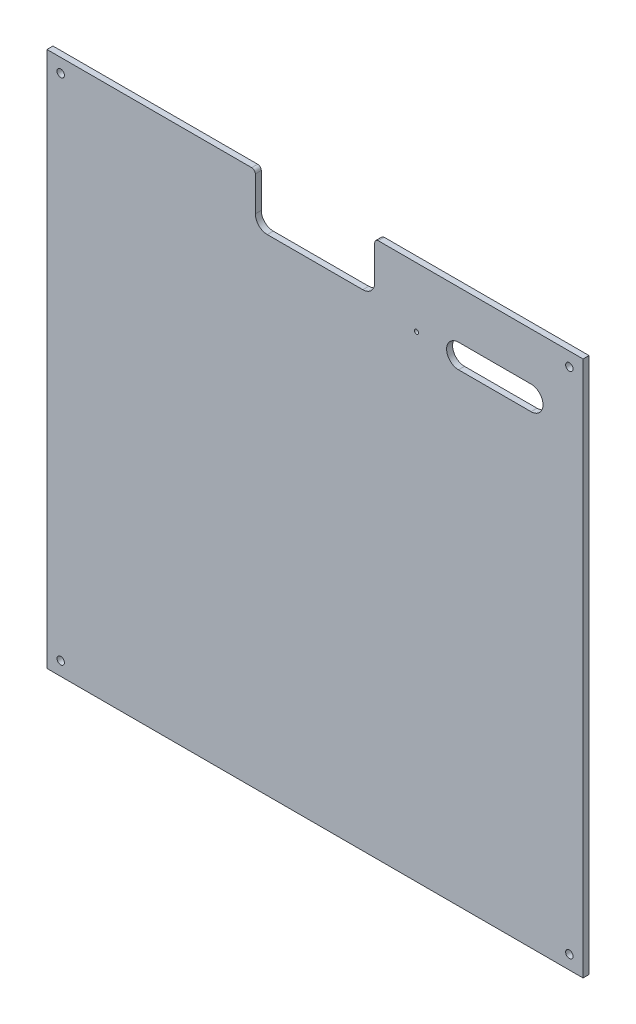
ISO-10303-21;
HEADER;
FILE_DESCRIPTION(('STEP AP214'),'2;1');
FILE_NAME('part.step','',(''),(''),'','','');
FILE_SCHEMA(('AUTOMOTIVE_DESIGN { 1 0 10303 214 1 1 1 1 }'));
ENDSEC;
DATA;
#1=APPLICATION_CONTEXT('core data for automotive mechanical design processes');
#2=APPLICATION_PROTOCOL_DEFINITION('international standard','automotive_design',2000,#1);
#3=PRODUCT_CONTEXT('',#1,'mechanical');
#4=PRODUCT('Part','Part','',(#3));
#5=PRODUCT_RELATED_PRODUCT_CATEGORY('part','',(#4));
#6=PRODUCT_DEFINITION_FORMATION('','',#4);
#7=PRODUCT_DEFINITION_CONTEXT('part definition',#1,'design');
#8=PRODUCT_DEFINITION('design','',#6,#7);
#9=PRODUCT_DEFINITION_SHAPE('','',#8);
#10=(LENGTH_UNIT() NAMED_UNIT(*) SI_UNIT(.MILLI.,.METRE.));
#11=(NAMED_UNIT(*) PLANE_ANGLE_UNIT() SI_UNIT($,.RADIAN.));
#12=(NAMED_UNIT(*) SI_UNIT($,.STERADIAN.) SOLID_ANGLE_UNIT());
#13=UNCERTAINTY_MEASURE_WITH_UNIT(LENGTH_MEASURE(1.E-05),#10,'distance_accuracy_value','');
#14=(GEOMETRIC_REPRESENTATION_CONTEXT(3) GLOBAL_UNCERTAINTY_ASSIGNED_CONTEXT((#13)) GLOBAL_UNIT_ASSIGNED_CONTEXT((#10,
#11,#12)) REPRESENTATION_CONTEXT('',''));
#15=CARTESIAN_POINT('',(0.,0.,0.));
#16=DIRECTION('',(0.,0.,1.));
#17=DIRECTION('',(1.,0.,0.));
#18=AXIS2_PLACEMENT_3D('',#15,#16,#17);
#19=CARTESIAN_POINT('',(171.5,446.,5.));
#20=DIRECTION('',(0.,0.,1.));
#21=DIRECTION('',(1.,0.,0.));
#22=AXIS2_PLACEMENT_3D('',#19,#20,#21);
#23=PLANE('',#22);
#24=DIRECTION('',(1.,0.,0.));
#25=VECTOR('',#24,1.);
#26=CARTESIAN_POINT('',(344.715899344631,389.,5.));
#27=LINE('',#26,#25);
#28=CARTESIAN_POINT('',(344.715899344631,389.,5.));
#29=VERTEX_POINT('',#28);
#30=CARTESIAN_POINT('',(405.440355678252,389.,5.));
#31=VERTEX_POINT('',#30);
#32=EDGE_CURVE('E164',#29,#31,#27,.T.);
#33=ORIENTED_EDGE('',*,*,#32,.F.);
#34=CARTESIAN_POINT('',(344.715899344631,399.,5.));
#35=DIRECTION('',(0.,0.,1.));
#36=DIRECTION('',(1.,0.,0.));
#37=AXIS2_PLACEMENT_3D('',#34,#35,#36);
#38=CIRCLE('',#37,10.);
#39=CARTESIAN_POINT('',(344.715899344631,409.,5.));
#40=VERTEX_POINT('',#39);
#41=EDGE_CURVE('E155',#40,#29,#38,.T.);
#42=ORIENTED_EDGE('',*,*,#41,.F.);
#43=DIRECTION('',(-1.,0.,0.));
#44=VECTOR('',#43,1.);
#45=CARTESIAN_POINT('',(344.715899344631,409.,5.));
#46=LINE('',#45,#44);
#47=CARTESIAN_POINT('',(405.440355678252,409.,5.));
#48=VERTEX_POINT('',#47);
#49=EDGE_CURVE('E181',#48,#40,#46,.T.);
#50=ORIENTED_EDGE('',*,*,#49,.F.);
#51=CARTESIAN_POINT('',(405.440355678252,399.,5.));
#52=DIRECTION('',(0.,0.,1.));
#53=DIRECTION('',(1.,0.,0.));
#54=AXIS2_PLACEMENT_3D('',#51,#52,#53);
#55=CIRCLE('',#54,10.);
#56=EDGE_CURVE('E177',#31,#48,#55,.T.);
#57=ORIENTED_EDGE('',*,*,#56,.F.);
#58=EDGE_LOOP('',(#33,#42,#50,#57));
#59=FACE_BOUND('',#58,.T.);
#60=CARTESIAN_POINT('',(11.5,437.5,5.));
#61=DIRECTION('',(0.,0.,1.));
#62=DIRECTION('',(-1.,0.,0.));
#63=AXIS2_PLACEMENT_3D('',#60,#61,#62);
#64=CIRCLE('',#63,3.1);
#65=CARTESIAN_POINT('',(8.4,437.5,5.));
#66=VERTEX_POINT('',#65);
#67=EDGE_CURVE('E277',#66,#66,#64,.T.);
#68=ORIENTED_EDGE('',*,*,#67,.F.);
#69=EDGE_LOOP('',(#68));
#70=FACE_BOUND('',#69,.T.);
#71=CARTESIAN_POINT('',(437.5,11.5,5.));
#72=DIRECTION('',(0.,0.,1.));
#73=DIRECTION('',(-1.,0.,0.));
#74=AXIS2_PLACEMENT_3D('',#71,#72,#73);
#75=CIRCLE('',#74,3.09999999999999);
#76=CARTESIAN_POINT('',(434.4,11.5,5.));
#77=VERTEX_POINT('',#76);
#78=EDGE_CURVE('E467',#77,#77,#75,.T.);
#79=ORIENTED_EDGE('',*,*,#78,.F.);
#80=EDGE_LOOP('',(#79));
#81=FACE_BOUND('',#80,.T.);
#82=DIRECTION('',(1.,0.,0.));
#83=VECTOR('',#82,1.);
#84=CARTESIAN_POINT('',(449.,0.,5.));
#85=LINE('',#84,#83);
#86=CARTESIAN_POINT('',(0.,0.,5.));
#87=VERTEX_POINT('',#86);
#88=CARTESIAN_POINT('',(449.,0.,5.));
#89=VERTEX_POINT('',#88);
#90=EDGE_CURVE('E425',#87,#89,#85,.T.);
#91=ORIENTED_EDGE('',*,*,#90,.T.);
#92=DIRECTION('',(0.,1.,0.));
#93=VECTOR('',#92,1.);
#94=CARTESIAN_POINT('',(449.,449.,5.));
#95=LINE('',#94,#93);
#96=CARTESIAN_POINT('',(449.,449.,5.));
#97=VERTEX_POINT('',#96);
#98=EDGE_CURVE('E458',#89,#97,#95,.T.);
#99=ORIENTED_EDGE('',*,*,#98,.T.);
#100=DIRECTION('',(-1.,0.,0.));
#101=VECTOR('',#100,1.);
#102=CARTESIAN_POINT('',(277.5,449.,5.));
#103=LINE('',#102,#101);
#104=CARTESIAN_POINT('',(277.5,449.,5.));
#105=VERTEX_POINT('',#104);
#106=EDGE_CURVE('E400',#97,#105,#103,.T.);
#107=ORIENTED_EDGE('',*,*,#106,.T.);
#108=CARTESIAN_POINT('',(277.5,446.,5.));
#109=DIRECTION('',(0.,0.,1.));
#110=DIRECTION('',(1.,0.,0.));
#111=AXIS2_PLACEMENT_3D('',#108,#109,#110);
#112=CIRCLE('',#111,3.);
#113=CARTESIAN_POINT('',(274.5,446.,5.));
#114=VERTEX_POINT('',#113);
#115=EDGE_CURVE('E212',#105,#114,#112,.T.);
#116=ORIENTED_EDGE('',*,*,#115,.T.);
#117=DIRECTION('',(0.,-1.,0.));
#118=VECTOR('',#117,1.);
#119=CARTESIAN_POINT('',(274.5,417.,5.));
#120=LINE('',#119,#118);
#121=CARTESIAN_POINT('',(274.5,417.,5.));
#122=VERTEX_POINT('',#121);
#123=EDGE_CURVE('E207',#114,#122,#120,.T.);
#124=ORIENTED_EDGE('',*,*,#123,.T.);
#125=CARTESIAN_POINT('',(264.5,417.,5.));
#126=DIRECTION('',(0.,0.,-1.));
#127=DIRECTION('',(-1.,0.,0.));
#128=AXIS2_PLACEMENT_3D('',#125,#126,#127);
#129=CIRCLE('',#128,10.);
#130=CARTESIAN_POINT('',(264.5,407.,5.));
#131=VERTEX_POINT('',#130);
#132=EDGE_CURVE('E211',#122,#131,#129,.T.);
#133=ORIENTED_EDGE('',*,*,#132,.T.);
#134=DIRECTION('',(-1.,0.,0.));
#135=VECTOR('',#134,1.);
#136=CARTESIAN_POINT('',(184.5,407.,5.));
#137=LINE('',#136,#135);
#138=CARTESIAN_POINT('',(184.5,407.,5.));
#139=VERTEX_POINT('',#138);
#140=EDGE_CURVE('E228',#131,#139,#137,.T.);
#141=ORIENTED_EDGE('',*,*,#140,.T.);
#142=CARTESIAN_POINT('',(184.5,417.,5.));
#143=DIRECTION('',(0.,0.,-1.));
#144=DIRECTION('',(1.,0.,0.));
#145=AXIS2_PLACEMENT_3D('',#142,#143,#144);
#146=CIRCLE('',#145,10.);
#147=CARTESIAN_POINT('',(174.5,417.,5.));
#148=VERTEX_POINT('',#147);
#149=EDGE_CURVE('E231',#139,#148,#146,.T.);
#150=ORIENTED_EDGE('',*,*,#149,.T.);
#151=DIRECTION('',(0.,1.,0.));
#152=VECTOR('',#151,1.);
#153=CARTESIAN_POINT('',(174.5,446.,5.));
#154=LINE('',#153,#152);
#155=CARTESIAN_POINT('',(174.5,446.,5.));
#156=VERTEX_POINT('',#155);
#157=EDGE_CURVE('E244',#148,#156,#154,.T.);
#158=ORIENTED_EDGE('',*,*,#157,.T.);
#159=CARTESIAN_POINT('',(171.5,446.,5.));
#160=DIRECTION('',(0.,0.,1.));
#161=DIRECTION('',(1.,0.,0.));
#162=AXIS2_PLACEMENT_3D('',#159,#160,#161);
#163=CIRCLE('',#162,2.99999999999998);
#164=CARTESIAN_POINT('',(171.5,449.,5.));
#165=VERTEX_POINT('',#164);
#166=EDGE_CURVE('E248',#156,#165,#163,.T.);
#167=ORIENTED_EDGE('',*,*,#166,.T.);
#168=DIRECTION('',(-1.,0.,0.));
#169=VECTOR('',#168,1.);
#170=CARTESIAN_POINT('',(0.,449.,5.));
#171=LINE('',#170,#169);
#172=CARTESIAN_POINT('',(0.,449.,5.));
#173=VERTEX_POINT('',#172);
#174=EDGE_CURVE('E654',#165,#173,#171,.T.);
#175=ORIENTED_EDGE('',*,*,#174,.T.);
#176=DIRECTION('',(0.,-1.,0.));
#177=VECTOR('',#176,1.);
#178=CARTESIAN_POINT('',(0.,0.,5.));
#179=LINE('',#178,#177);
#180=EDGE_CURVE('E430',#173,#87,#179,.T.);
#181=ORIENTED_EDGE('',*,*,#180,.T.);
#182=EDGE_LOOP('',(#91,#99,#107,#116,#124,#133,#141,#150,#158,#167,#175,#181));
#183=FACE_BOUND('',#182,.T.);
#184=CARTESIAN_POINT('',(11.5,11.5,5.));
#185=DIRECTION('',(0.,0.,1.));
#186=DIRECTION('',(1.,0.,0.));
#187=AXIS2_PLACEMENT_3D('',#184,#185,#186);
#188=CIRCLE('',#187,3.1);
#189=CARTESIAN_POINT('',(14.6,11.5,5.));
#190=VERTEX_POINT('',#189);
#191=EDGE_CURVE('E466',#190,#190,#188,.T.);
#192=ORIENTED_EDGE('',*,*,#191,.F.);
#193=EDGE_LOOP('',(#192));
#194=FACE_BOUND('',#193,.T.);
#195=CARTESIAN_POINT('',(437.5,437.5,5.));
#196=DIRECTION('',(0.,0.,1.));
#197=DIRECTION('',(1.,0.,0.));
#198=AXIS2_PLACEMENT_3D('',#195,#196,#197);
#199=CIRCLE('',#198,3.09999999999999);
#200=CARTESIAN_POINT('',(440.6,437.5,5.));
#201=VERTEX_POINT('',#200);
#202=EDGE_CURVE('E259',#201,#201,#199,.T.);
#203=ORIENTED_EDGE('',*,*,#202,.F.);
#204=EDGE_LOOP('',(#203));
#205=FACE_BOUND('',#204,.T.);
#206=CARTESIAN_POINT('',(309.5,399.,5.));
#207=DIRECTION('',(0.,0.,1.));
#208=DIRECTION('',(1.,0.,0.));
#209=AXIS2_PLACEMENT_3D('',#206,#207,#208);
#210=CIRCLE('',#209,1.74999999999998);
#211=CARTESIAN_POINT('',(311.25,399.,5.));
#212=VERTEX_POINT('',#211);
#213=EDGE_CURVE('E289',#212,#212,#210,.T.);
#214=ORIENTED_EDGE('',*,*,#213,.F.);
#215=EDGE_LOOP('',(#214));
#216=FACE_BOUND('',#215,.T.);
#217=ADVANCED_FACE('F41',(#59,#70,#81,#183,#194,#205,#216),#23,.T.);
#218=CARTESIAN_POINT('',(171.5,446.,0.));
#219=DIRECTION('',(0.,0.,1.));
#220=DIRECTION('',(1.,0.,0.));
#221=AXIS2_PLACEMENT_3D('',#218,#219,#220);
#222=PLANE('',#221);
#223=CARTESIAN_POINT('',(11.5,437.5,0.));
#224=DIRECTION('',(0.,0.,1.));
#225=DIRECTION('',(-1.,0.,0.));
#226=AXIS2_PLACEMENT_3D('',#223,#224,#225);
#227=CIRCLE('',#226,3.1);
#228=CARTESIAN_POINT('',(8.4,437.5,0.));
#229=VERTEX_POINT('',#228);
#230=EDGE_CURVE('E172',#229,#229,#227,.T.);
#231=ORIENTED_EDGE('',*,*,#230,.T.);
#232=EDGE_LOOP('',(#231));
#233=FACE_BOUND('',#232,.T.);
#234=CARTESIAN_POINT('',(437.5,437.5,0.));
#235=DIRECTION('',(0.,0.,1.));
#236=DIRECTION('',(1.,0.,0.));
#237=AXIS2_PLACEMENT_3D('',#234,#235,#236);
#238=CIRCLE('',#237,3.09999999999999);
#239=CARTESIAN_POINT('',(440.6,437.5,0.));
#240=VERTEX_POINT('',#239);
#241=EDGE_CURVE('E266',#240,#240,#238,.T.);
#242=ORIENTED_EDGE('',*,*,#241,.T.);
#243=EDGE_LOOP('',(#242));
#244=FACE_BOUND('',#243,.T.);
#245=CARTESIAN_POINT('',(437.5,11.5,0.));
#246=DIRECTION('',(0.,0.,1.));
#247=DIRECTION('',(-1.,0.,0.));
#248=AXIS2_PLACEMENT_3D('',#245,#246,#247);
#249=CIRCLE('',#248,3.09999999999999);
#250=CARTESIAN_POINT('',(434.4,11.5,0.));
#251=VERTEX_POINT('',#250);
#252=EDGE_CURVE('E265',#251,#251,#249,.T.);
#253=ORIENTED_EDGE('',*,*,#252,.T.);
#254=EDGE_LOOP('',(#253));
#255=FACE_BOUND('',#254,.T.);
#256=CARTESIAN_POINT('',(11.5,11.5,0.));
#257=DIRECTION('',(0.,0.,1.));
#258=DIRECTION('',(1.,0.,0.));
#259=AXIS2_PLACEMENT_3D('',#256,#257,#258);
#260=CIRCLE('',#259,3.1);
#261=CARTESIAN_POINT('',(14.6,11.5,0.));
#262=VERTEX_POINT('',#261);
#263=EDGE_CURVE('E463',#262,#262,#260,.T.);
#264=ORIENTED_EDGE('',*,*,#263,.T.);
#265=EDGE_LOOP('',(#264));
#266=FACE_BOUND('',#265,.T.);
#267=DIRECTION('',(1.,0.,0.));
#268=VECTOR('',#267,1.);
#269=CARTESIAN_POINT('',(449.,0.,0.));
#270=LINE('',#269,#268);
#271=CARTESIAN_POINT('',(0.,0.,0.));
#272=VERTEX_POINT('',#271);
#273=CARTESIAN_POINT('',(449.,0.,0.));
#274=VERTEX_POINT('',#273);
#275=EDGE_CURVE('E396',#272,#274,#270,.T.);
#276=ORIENTED_EDGE('',*,*,#275,.F.);
#277=DIRECTION('',(0.,-1.,0.));
#278=VECTOR('',#277,1.);
#279=CARTESIAN_POINT('',(0.,0.,0.));
#280=LINE('',#279,#278);
#281=CARTESIAN_POINT('',(0.,449.,0.));
#282=VERTEX_POINT('',#281);
#283=EDGE_CURVE('E423',#282,#272,#280,.T.);
#284=ORIENTED_EDGE('',*,*,#283,.F.);
#285=DIRECTION('',(-1.,0.,0.));
#286=VECTOR('',#285,1.);
#287=CARTESIAN_POINT('',(0.,449.,0.));
#288=LINE('',#287,#286);
#289=CARTESIAN_POINT('',(171.5,449.,0.));
#290=VERTEX_POINT('',#289);
#291=EDGE_CURVE('E421',#290,#282,#288,.T.);
#292=ORIENTED_EDGE('',*,*,#291,.F.);
#293=CARTESIAN_POINT('',(171.5,446.,0.));
#294=DIRECTION('',(0.,0.,1.));
#295=DIRECTION('',(1.,0.,0.));
#296=AXIS2_PLACEMENT_3D('',#293,#294,#295);
#297=CIRCLE('',#296,2.99999999999998);
#298=CARTESIAN_POINT('',(174.5,446.,0.));
#299=VERTEX_POINT('',#298);
#300=EDGE_CURVE('E419',#299,#290,#297,.T.);
#301=ORIENTED_EDGE('',*,*,#300,.F.);
#302=DIRECTION('',(0.,1.,0.));
#303=VECTOR('',#302,1.);
#304=CARTESIAN_POINT('',(174.5,446.,0.));
#305=LINE('',#304,#303);
#306=CARTESIAN_POINT('',(174.5,417.,0.));
#307=VERTEX_POINT('',#306);
#308=EDGE_CURVE('E417',#307,#299,#305,.T.);
#309=ORIENTED_EDGE('',*,*,#308,.F.);
#310=CARTESIAN_POINT('',(184.5,417.,0.));
#311=DIRECTION('',(0.,0.,-1.));
#312=DIRECTION('',(1.,0.,0.));
#313=AXIS2_PLACEMENT_3D('',#310,#311,#312);
#314=CIRCLE('',#313,10.);
#315=CARTESIAN_POINT('',(184.5,407.,0.));
#316=VERTEX_POINT('',#315);
#317=EDGE_CURVE('E415',#316,#307,#314,.T.);
#318=ORIENTED_EDGE('',*,*,#317,.F.);
#319=DIRECTION('',(-1.,0.,0.));
#320=VECTOR('',#319,1.);
#321=CARTESIAN_POINT('',(184.5,407.,0.));
#322=LINE('',#321,#320);
#323=CARTESIAN_POINT('',(264.5,407.,0.));
#324=VERTEX_POINT('',#323);
#325=EDGE_CURVE('E413',#324,#316,#322,.T.);
#326=ORIENTED_EDGE('',*,*,#325,.F.);
#327=CARTESIAN_POINT('',(264.5,417.,0.));
#328=DIRECTION('',(0.,0.,-1.));
#329=DIRECTION('',(-1.,0.,0.));
#330=AXIS2_PLACEMENT_3D('',#327,#328,#329);
#331=CIRCLE('',#330,10.);
#332=CARTESIAN_POINT('',(274.5,417.,0.));
#333=VERTEX_POINT('',#332);
#334=EDGE_CURVE('E411',#333,#324,#331,.T.);
#335=ORIENTED_EDGE('',*,*,#334,.F.);
#336=DIRECTION('',(0.,-1.,0.));
#337=VECTOR('',#336,1.);
#338=CARTESIAN_POINT('',(274.5,417.,0.));
#339=LINE('',#338,#337);
#340=CARTESIAN_POINT('',(274.5,446.,0.));
#341=VERTEX_POINT('',#340);
#342=EDGE_CURVE('E406',#341,#333,#339,.T.);
#343=ORIENTED_EDGE('',*,*,#342,.F.);
#344=CARTESIAN_POINT('',(277.5,446.,0.));
#345=DIRECTION('',(0.,0.,1.));
#346=DIRECTION('',(1.,0.,0.));
#347=AXIS2_PLACEMENT_3D('',#344,#345,#346);
#348=CIRCLE('',#347,3.);
#349=CARTESIAN_POINT('',(277.5,449.,0.));
#350=VERTEX_POINT('',#349);
#351=EDGE_CURVE('E404',#350,#341,#348,.T.);
#352=ORIENTED_EDGE('',*,*,#351,.F.);
#353=DIRECTION('',(-1.,0.,0.));
#354=VECTOR('',#353,1.);
#355=CARTESIAN_POINT('',(277.5,449.,0.));
#356=LINE('',#355,#354);
#357=CARTESIAN_POINT('',(449.,449.,0.));
#358=VERTEX_POINT('',#357);
#359=EDGE_CURVE('E395',#358,#350,#356,.T.);
#360=ORIENTED_EDGE('',*,*,#359,.F.);
#361=DIRECTION('',(0.,1.,0.));
#362=VECTOR('',#361,1.);
#363=CARTESIAN_POINT('',(449.,449.,0.));
#364=LINE('',#363,#362);
#365=EDGE_CURVE('E387',#274,#358,#364,.T.);
#366=ORIENTED_EDGE('',*,*,#365,.F.);
#367=EDGE_LOOP('',(#276,#284,#292,#301,#309,#318,#326,#335,#343,#352,#360,#366));
#368=FACE_BOUND('',#367,.T.);
#369=CARTESIAN_POINT('',(344.715899344631,399.,0.));
#370=DIRECTION('',(0.,0.,1.));
#371=DIRECTION('',(1.,0.,0.));
#372=AXIS2_PLACEMENT_3D('',#369,#370,#371);
#373=CIRCLE('',#372,10.);
#374=CARTESIAN_POINT('',(344.715899344631,409.,0.));
#375=VERTEX_POINT('',#374);
#376=CARTESIAN_POINT('',(344.715899344631,389.,0.));
#377=VERTEX_POINT('',#376);
#378=EDGE_CURVE('E64',#375,#377,#373,.T.);
#379=ORIENTED_EDGE('',*,*,#378,.T.);
#380=DIRECTION('',(1.,0.,0.));
#381=VECTOR('',#380,1.);
#382=CARTESIAN_POINT('',(344.715899344631,389.,0.));
#383=LINE('',#382,#381);
#384=CARTESIAN_POINT('',(405.440355678252,389.,0.));
#385=VERTEX_POINT('',#384);
#386=EDGE_CURVE('E171',#377,#385,#383,.T.);
#387=ORIENTED_EDGE('',*,*,#386,.T.);
#388=CARTESIAN_POINT('',(405.440355678252,399.,0.));
#389=DIRECTION('',(0.,0.,1.));
#390=DIRECTION('',(1.,0.,0.));
#391=AXIS2_PLACEMENT_3D('',#388,#389,#390);
#392=CIRCLE('',#391,10.);
#393=CARTESIAN_POINT('',(405.440355678252,409.,0.));
#394=VERTEX_POINT('',#393);
#395=EDGE_CURVE('E306',#385,#394,#392,.T.);
#396=ORIENTED_EDGE('',*,*,#395,.T.);
#397=DIRECTION('',(-1.,0.,0.));
#398=VECTOR('',#397,1.);
#399=CARTESIAN_POINT('',(344.715899344631,409.,0.));
#400=LINE('',#399,#398);
#401=EDGE_CURVE('E165',#394,#375,#400,.T.);
#402=ORIENTED_EDGE('',*,*,#401,.T.);
#403=EDGE_LOOP('',(#379,#387,#396,#402));
#404=FACE_BOUND('',#403,.T.);
#405=CARTESIAN_POINT('',(309.5,399.,0.));
#406=DIRECTION('',(0.,0.,1.));
#407=DIRECTION('',(1.,0.,0.));
#408=AXIS2_PLACEMENT_3D('',#405,#406,#407);
#409=CIRCLE('',#408,1.74999999999998);
#410=CARTESIAN_POINT('',(311.25,399.,0.));
#411=VERTEX_POINT('',#410);
#412=EDGE_CURVE('E293',#411,#411,#409,.T.);
#413=ORIENTED_EDGE('',*,*,#412,.T.);
#414=EDGE_LOOP('',(#413));
#415=FACE_BOUND('',#414,.T.);
#416=ADVANCED_FACE('F316',(#233,#244,#255,#266,#368,#404,#415),#222,.F.);
#417=CARTESIAN_POINT('',(449.,0.,5.));
#418=DIRECTION('',(0.,1.,0.));
#419=DIRECTION('',(0.,0.,1.));
#420=AXIS2_PLACEMENT_3D('',#417,#418,#419);
#421=PLANE('',#420);
#422=ORIENTED_EDGE('',*,*,#275,.T.);
#423=DIRECTION('',(0.,0.,-1.));
#424=VECTOR('',#423,1.);
#425=CARTESIAN_POINT('',(449.,0.,5.));
#426=LINE('',#425,#424);
#427=EDGE_CURVE('E12',#89,#274,#426,.T.);
#428=ORIENTED_EDGE('',*,*,#427,.F.);
#429=ORIENTED_EDGE('',*,*,#90,.F.);
#430=DIRECTION('',(0.,0.,-1.));
#431=VECTOR('',#430,1.);
#432=CARTESIAN_POINT('',(0.,0.,5.));
#433=LINE('',#432,#431);
#434=EDGE_CURVE('E426',#87,#272,#433,.T.);
#435=ORIENTED_EDGE('',*,*,#434,.T.);
#436=EDGE_LOOP('',(#422,#428,#429,#435));
#437=FACE_BOUND('',#436,.T.);
#438=ADVANCED_FACE('F43',(#437),#421,.F.);
#439=CARTESIAN_POINT('',(449.,449.,5.));
#440=DIRECTION('',(-1.,0.,0.));
#441=DIRECTION('',(0.,-1.,0.));
#442=AXIS2_PLACEMENT_3D('',#439,#440,#441);
#443=PLANE('',#442);
#444=ORIENTED_EDGE('',*,*,#365,.T.);
#445=DIRECTION('',(0.,0.,-1.));
#446=VECTOR('',#445,1.);
#447=CARTESIAN_POINT('',(449.,449.,5.));
#448=LINE('',#447,#446);
#449=EDGE_CURVE('E49',#97,#358,#448,.T.);
#450=ORIENTED_EDGE('',*,*,#449,.F.);
#451=ORIENTED_EDGE('',*,*,#98,.F.);
#452=ORIENTED_EDGE('',*,*,#427,.T.);
#453=EDGE_LOOP('',(#444,#450,#451,#452));
#454=FACE_BOUND('',#453,.T.);
#455=ADVANCED_FACE('F378',(#454),#443,.F.);
#456=CARTESIAN_POINT('',(277.5,449.,5.));
#457=DIRECTION('',(0.,-1.,0.));
#458=DIRECTION('',(0.,0.,-1.));
#459=AXIS2_PLACEMENT_3D('',#456,#457,#458);
#460=PLANE('',#459);
#461=ORIENTED_EDGE('',*,*,#359,.T.);
#462=DIRECTION('',(0.,0.,-1.));
#463=VECTOR('',#462,1.);
#464=CARTESIAN_POINT('',(277.5,449.,5.));
#465=LINE('',#464,#463);
#466=EDGE_CURVE('E401',#105,#350,#465,.T.);
#467=ORIENTED_EDGE('',*,*,#466,.F.);
#468=ORIENTED_EDGE('',*,*,#106,.F.);
#469=ORIENTED_EDGE('',*,*,#449,.T.);
#470=EDGE_LOOP('',(#461,#467,#468,#469));
#471=FACE_BOUND('',#470,.T.);
#472=ADVANCED_FACE('F375',(#471),#460,.F.);
#473=CARTESIAN_POINT('',(277.5,446.,5.));
#474=DIRECTION('',(0.,0.,-1.));
#475=DIRECTION('',(-1.,0.,0.));
#476=AXIS2_PLACEMENT_3D('',#473,#474,#475);
#477=CYLINDRICAL_SURFACE('',#476,3.);
#478=ORIENTED_EDGE('',*,*,#351,.T.);
#479=DIRECTION('',(0.,0.,-1.));
#480=VECTOR('',#479,1.);
#481=CARTESIAN_POINT('',(274.5,446.,5.));
#482=LINE('',#481,#480);
#483=EDGE_CURVE('E451',#114,#341,#482,.T.);
#484=ORIENTED_EDGE('',*,*,#483,.F.);
#485=ORIENTED_EDGE('',*,*,#115,.F.);
#486=ORIENTED_EDGE('',*,*,#466,.T.);
#487=EDGE_LOOP('',(#478,#484,#485,#486));
#488=FACE_BOUND('',#487,.T.);
#489=ADVANCED_FACE('F371',(#488),#477,.T.);
#490=CARTESIAN_POINT('',(274.5,417.,5.));
#491=DIRECTION('',(1.,0.,0.));
#492=DIRECTION('',(0.,1.,0.));
#493=AXIS2_PLACEMENT_3D('',#490,#491,#492);
#494=PLANE('',#493);
#495=ORIENTED_EDGE('',*,*,#342,.T.);
#496=DIRECTION('',(0.,0.,-1.));
#497=VECTOR('',#496,1.);
#498=CARTESIAN_POINT('',(274.5,417.,5.));
#499=LINE('',#498,#497);
#500=EDGE_CURVE('E448',#122,#333,#499,.T.);
#501=ORIENTED_EDGE('',*,*,#500,.F.);
#502=ORIENTED_EDGE('',*,*,#123,.F.);
#503=ORIENTED_EDGE('',*,*,#483,.T.);
#504=EDGE_LOOP('',(#495,#501,#502,#503));
#505=FACE_BOUND('',#504,.T.);
#506=ADVANCED_FACE('F367',(#505),#494,.F.);
#507=CARTESIAN_POINT('',(264.5,417.,5.));
#508=DIRECTION('',(0.,0.,-1.));
#509=DIRECTION('',(-1.,0.,0.));
#510=AXIS2_PLACEMENT_3D('',#507,#508,#509);
#511=CYLINDRICAL_SURFACE('',#510,10.);
#512=ORIENTED_EDGE('',*,*,#334,.T.);
#513=DIRECTION('',(0.,0.,-1.));
#514=VECTOR('',#513,1.);
#515=CARTESIAN_POINT('',(264.5,407.,5.));
#516=LINE('',#515,#514);
#517=EDGE_CURVE('E445',#131,#324,#516,.T.);
#518=ORIENTED_EDGE('',*,*,#517,.F.);
#519=ORIENTED_EDGE('',*,*,#132,.F.);
#520=ORIENTED_EDGE('',*,*,#500,.T.);
#521=EDGE_LOOP('',(#512,#518,#519,#520));
#522=FACE_BOUND('',#521,.T.);
#523=ADVANCED_FACE('F363',(#522),#511,.F.);
#524=CARTESIAN_POINT('',(184.5,407.,5.));
#525=DIRECTION('',(0.,-1.,0.));
#526=DIRECTION('',(0.,0.,-1.));
#527=AXIS2_PLACEMENT_3D('',#524,#525,#526);
#528=PLANE('',#527);
#529=ORIENTED_EDGE('',*,*,#325,.T.);
#530=DIRECTION('',(0.,0.,-1.));
#531=VECTOR('',#530,1.);
#532=CARTESIAN_POINT('',(184.5,407.,5.));
#533=LINE('',#532,#531);
#534=EDGE_CURVE('E442',#139,#316,#533,.T.);
#535=ORIENTED_EDGE('',*,*,#534,.F.);
#536=ORIENTED_EDGE('',*,*,#140,.F.);
#537=ORIENTED_EDGE('',*,*,#517,.T.);
#538=EDGE_LOOP('',(#529,#535,#536,#537));
#539=FACE_BOUND('',#538,.T.);
#540=ADVANCED_FACE('F359',(#539),#528,.F.);
#541=CARTESIAN_POINT('',(184.5,417.,5.));
#542=DIRECTION('',(0.,0.,-1.));
#543=DIRECTION('',(-1.,0.,0.));
#544=AXIS2_PLACEMENT_3D('',#541,#542,#543);
#545=CYLINDRICAL_SURFACE('',#544,10.);
#546=ORIENTED_EDGE('',*,*,#317,.T.);
#547=DIRECTION('',(0.,0.,-1.));
#548=VECTOR('',#547,1.);
#549=CARTESIAN_POINT('',(174.5,417.,5.));
#550=LINE('',#549,#548);
#551=EDGE_CURVE('E439',#148,#307,#550,.T.);
#552=ORIENTED_EDGE('',*,*,#551,.F.);
#553=ORIENTED_EDGE('',*,*,#149,.F.);
#554=ORIENTED_EDGE('',*,*,#534,.T.);
#555=EDGE_LOOP('',(#546,#552,#553,#554));
#556=FACE_BOUND('',#555,.T.);
#557=ADVANCED_FACE('F355',(#556),#545,.F.);
#558=CARTESIAN_POINT('',(174.5,446.,5.));
#559=DIRECTION('',(-1.,0.,0.));
#560=DIRECTION('',(0.,-1.,0.));
#561=AXIS2_PLACEMENT_3D('',#558,#559,#560);
#562=PLANE('',#561);
#563=ORIENTED_EDGE('',*,*,#308,.T.);
#564=DIRECTION('',(0.,0.,-1.));
#565=VECTOR('',#564,1.);
#566=CARTESIAN_POINT('',(174.5,446.,5.));
#567=LINE('',#566,#565);
#568=EDGE_CURVE('E436',#156,#299,#567,.T.);
#569=ORIENTED_EDGE('',*,*,#568,.F.);
#570=ORIENTED_EDGE('',*,*,#157,.F.);
#571=ORIENTED_EDGE('',*,*,#551,.T.);
#572=EDGE_LOOP('',(#563,#569,#570,#571));
#573=FACE_BOUND('',#572,.T.);
#574=ADVANCED_FACE('F351',(#573),#562,.F.);
#575=CARTESIAN_POINT('',(171.5,446.,5.));
#576=DIRECTION('',(0.,0.,-1.));
#577=DIRECTION('',(-1.,0.,0.));
#578=AXIS2_PLACEMENT_3D('',#575,#576,#577);
#579=CYLINDRICAL_SURFACE('',#578,2.99999999999998);
#580=ORIENTED_EDGE('',*,*,#300,.T.);
#581=DIRECTION('',(0.,0.,-1.));
#582=VECTOR('',#581,1.);
#583=CARTESIAN_POINT('',(171.5,449.,5.));
#584=LINE('',#583,#582);
#585=EDGE_CURVE('E433',#165,#290,#584,.T.);
#586=ORIENTED_EDGE('',*,*,#585,.F.);
#587=ORIENTED_EDGE('',*,*,#166,.F.);
#588=ORIENTED_EDGE('',*,*,#568,.T.);
#589=EDGE_LOOP('',(#580,#586,#587,#588));
#590=FACE_BOUND('',#589,.T.);
#591=ADVANCED_FACE('F347',(#590),#579,.T.);
#592=CARTESIAN_POINT('',(0.,449.,5.));
#593=DIRECTION('',(0.,-1.,0.));
#594=DIRECTION('',(0.,0.,-1.));
#595=AXIS2_PLACEMENT_3D('',#592,#593,#594);
#596=PLANE('',#595);
#597=ORIENTED_EDGE('',*,*,#291,.T.);
#598=DIRECTION('',(0.,0.,-1.));
#599=VECTOR('',#598,1.);
#600=CARTESIAN_POINT('',(0.,449.,5.));
#601=LINE('',#600,#599);
#602=EDGE_CURVE('E429',#173,#282,#601,.T.);
#603=ORIENTED_EDGE('',*,*,#602,.F.);
#604=ORIENTED_EDGE('',*,*,#174,.F.);
#605=ORIENTED_EDGE('',*,*,#585,.T.);
#606=EDGE_LOOP('',(#597,#603,#604,#605));
#607=FACE_BOUND('',#606,.T.);
#608=ADVANCED_FACE('F343',(#607),#596,.F.);
#609=CARTESIAN_POINT('',(0.,0.,5.));
#610=DIRECTION('',(1.,0.,0.));
#611=DIRECTION('',(0.,0.,-1.));
#612=AXIS2_PLACEMENT_3D('',#609,#610,#611);
#613=PLANE('',#612);
#614=ORIENTED_EDGE('',*,*,#283,.T.);
#615=ORIENTED_EDGE('',*,*,#434,.F.);
#616=ORIENTED_EDGE('',*,*,#180,.F.);
#617=ORIENTED_EDGE('',*,*,#602,.T.);
#618=EDGE_LOOP('',(#614,#615,#616,#617));
#619=FACE_BOUND('',#618,.T.);
#620=ADVANCED_FACE('F340',(#619),#613,.F.);
#621=CARTESIAN_POINT('',(11.5,11.5,5.));
#622=DIRECTION('',(0.,0.,-1.));
#623=DIRECTION('',(-1.,0.,0.));
#624=AXIS2_PLACEMENT_3D('',#621,#622,#623);
#625=CYLINDRICAL_SURFACE('',#624,3.1);
#626=ORIENTED_EDGE('',*,*,#191,.T.);
#627=EDGE_LOOP('',(#626));
#628=FACE_BOUND('',#627,.T.);
#629=ORIENTED_EDGE('',*,*,#263,.F.);
#630=EDGE_LOOP('',(#629));
#631=FACE_BOUND('',#630,.T.);
#632=ADVANCED_FACE('F337',(#628,#631),#625,.F.);
#633=CARTESIAN_POINT('',(437.5,11.5,5.));
#634=DIRECTION('',(0.,0.,-1.));
#635=DIRECTION('',(-1.,0.,0.));
#636=AXIS2_PLACEMENT_3D('',#633,#634,#635);
#637=CYLINDRICAL_SURFACE('',#636,3.09999999999999);
#638=ORIENTED_EDGE('',*,*,#78,.T.);
#639=EDGE_LOOP('',(#638));
#640=FACE_BOUND('',#639,.T.);
#641=ORIENTED_EDGE('',*,*,#252,.F.);
#642=EDGE_LOOP('',(#641));
#643=FACE_BOUND('',#642,.T.);
#644=ADVANCED_FACE('F474',(#640,#643),#637,.F.);
#645=CARTESIAN_POINT('',(437.5,437.5,5.));
#646=DIRECTION('',(0.,0.,-1.));
#647=DIRECTION('',(-1.,0.,0.));
#648=AXIS2_PLACEMENT_3D('',#645,#646,#647);
#649=CYLINDRICAL_SURFACE('',#648,3.09999999999999);
#650=ORIENTED_EDGE('',*,*,#202,.T.);
#651=EDGE_LOOP('',(#650));
#652=FACE_BOUND('',#651,.T.);
#653=ORIENTED_EDGE('',*,*,#241,.F.);
#654=EDGE_LOOP('',(#653));
#655=FACE_BOUND('',#654,.T.);
#656=ADVANCED_FACE('F488',(#652,#655),#649,.F.);
#657=CARTESIAN_POINT('',(11.5,437.5,5.));
#658=DIRECTION('',(0.,0.,-1.));
#659=DIRECTION('',(-1.,0.,0.));
#660=AXIS2_PLACEMENT_3D('',#657,#658,#659);
#661=CYLINDRICAL_SURFACE('',#660,3.1);
#662=ORIENTED_EDGE('',*,*,#67,.T.);
#663=EDGE_LOOP('',(#662));
#664=FACE_BOUND('',#663,.T.);
#665=ORIENTED_EDGE('',*,*,#230,.F.);
#666=EDGE_LOOP('',(#665));
#667=FACE_BOUND('',#666,.T.);
#668=ADVANCED_FACE('F491',(#664,#667),#661,.F.);
#669=CARTESIAN_POINT('',(344.715899344631,399.,5.));
#670=DIRECTION('',(0.,0.,-1.));
#671=DIRECTION('',(-1.,0.,0.));
#672=AXIS2_PLACEMENT_3D('',#669,#670,#671);
#673=CYLINDRICAL_SURFACE('',#672,10.);
#674=ORIENTED_EDGE('',*,*,#378,.F.);
#675=DIRECTION('',(0.,0.,-1.));
#676=VECTOR('',#675,1.);
#677=CARTESIAN_POINT('',(344.715899344631,409.,5.));
#678=LINE('',#677,#676);
#679=EDGE_CURVE('E159',#40,#375,#678,.T.);
#680=ORIENTED_EDGE('',*,*,#679,.F.);
#681=ORIENTED_EDGE('',*,*,#41,.T.);
#682=DIRECTION('',(0.,0.,-1.));
#683=VECTOR('',#682,1.);
#684=CARTESIAN_POINT('',(344.715899344631,389.,5.));
#685=LINE('',#684,#683);
#686=EDGE_CURVE('E158',#29,#377,#685,.T.);
#687=ORIENTED_EDGE('',*,*,#686,.T.);
#688=EDGE_LOOP('',(#674,#680,#681,#687));
#689=FACE_BOUND('',#688,.T.);
#690=ADVANCED_FACE('F157',(#689),#673,.F.);
#691=CARTESIAN_POINT('',(344.715899344631,389.,5.));
#692=DIRECTION('',(0.,1.,0.));
#693=DIRECTION('',(0.,0.,1.));
#694=AXIS2_PLACEMENT_3D('',#691,#692,#693);
#695=PLANE('',#694);
#696=ORIENTED_EDGE('',*,*,#386,.F.);
#697=ORIENTED_EDGE('',*,*,#686,.F.);
#698=ORIENTED_EDGE('',*,*,#32,.T.);
#699=DIRECTION('',(0.,0.,-1.));
#700=VECTOR('',#699,1.);
#701=CARTESIAN_POINT('',(405.440355678252,389.,5.));
#702=LINE('',#701,#700);
#703=EDGE_CURVE('E173',#31,#385,#702,.T.);
#704=ORIENTED_EDGE('',*,*,#703,.T.);
#705=EDGE_LOOP('',(#696,#697,#698,#704));
#706=FACE_BOUND('',#705,.T.);
#707=ADVANCED_FACE('F168',(#706),#695,.T.);
#708=CARTESIAN_POINT('',(405.440355678252,399.,5.));
#709=DIRECTION('',(0.,0.,-1.));
#710=DIRECTION('',(-1.,0.,0.));
#711=AXIS2_PLACEMENT_3D('',#708,#709,#710);
#712=CYLINDRICAL_SURFACE('',#711,10.);
#713=ORIENTED_EDGE('',*,*,#395,.F.);
#714=ORIENTED_EDGE('',*,*,#703,.F.);
#715=ORIENTED_EDGE('',*,*,#56,.T.);
#716=DIRECTION('',(0.,0.,-1.));
#717=VECTOR('',#716,1.);
#718=CARTESIAN_POINT('',(405.440355678252,409.,5.));
#719=LINE('',#718,#717);
#720=EDGE_CURVE('E56',#48,#394,#719,.T.);
#721=ORIENTED_EDGE('',*,*,#720,.T.);
#722=EDGE_LOOP('',(#713,#714,#715,#721));
#723=FACE_BOUND('',#722,.T.);
#724=ADVANCED_FACE('F314',(#723),#712,.F.);
#725=CARTESIAN_POINT('',(344.715899344631,409.,5.));
#726=DIRECTION('',(0.,-1.,0.));
#727=DIRECTION('',(0.,0.,-1.));
#728=AXIS2_PLACEMENT_3D('',#725,#726,#727);
#729=PLANE('',#728);
#730=ORIENTED_EDGE('',*,*,#401,.F.);
#731=ORIENTED_EDGE('',*,*,#720,.F.);
#732=ORIENTED_EDGE('',*,*,#49,.T.);
#733=ORIENTED_EDGE('',*,*,#679,.T.);
#734=EDGE_LOOP('',(#730,#731,#732,#733));
#735=FACE_BOUND('',#734,.T.);
#736=ADVANCED_FACE('F318',(#735),#729,.T.);
#737=CARTESIAN_POINT('',(309.5,399.,5.));
#738=DIRECTION('',(0.,0.,-1.));
#739=DIRECTION('',(-1.,0.,0.));
#740=AXIS2_PLACEMENT_3D('',#737,#738,#739);
#741=CYLINDRICAL_SURFACE('',#740,1.74999999999998);
#742=ORIENTED_EDGE('',*,*,#213,.T.);
#743=EDGE_LOOP('',(#742));
#744=FACE_BOUND('',#743,.T.);
#745=ORIENTED_EDGE('',*,*,#412,.F.);
#746=EDGE_LOOP('',(#745));
#747=FACE_BOUND('',#746,.T.);
#748=ADVANCED_FACE('F320',(#744,#747),#741,.F.);
#749=CLOSED_SHELL('',(#217,#416,#438,#455,#472,#489,#506,#523,#540,#557,#574,#591,#608,#620,
#632,#644,#656,#668,#690,#707,#724,#736,#748));
#750=MANIFOLD_SOLID_BREP('B2',#749);
#751=ADVANCED_BREP_SHAPE_REPRESENTATION('',(#18,#750),#14);
#752=SHAPE_DEFINITION_REPRESENTATION(#9,#751);
ENDSEC;
END-ISO-10303-21;
